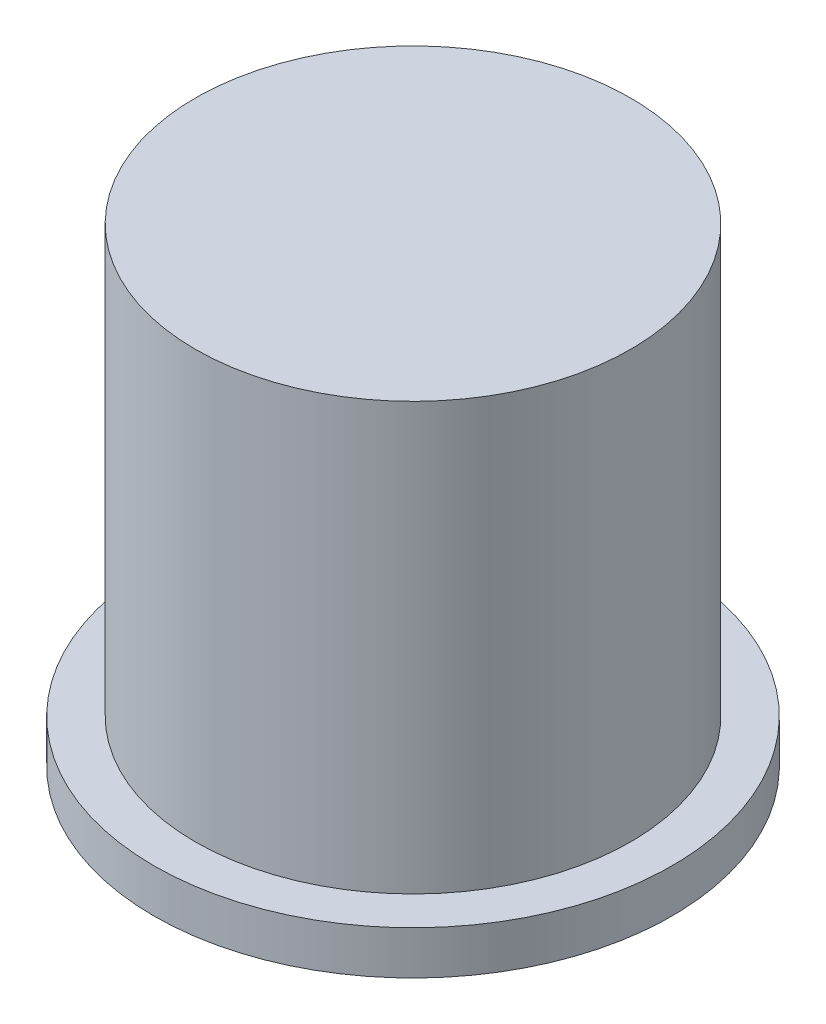
ISO-10303-21;
HEADER;
FILE_DESCRIPTION(('STEP AP214'),'2;1');
FILE_NAME('part.step','',(''),(''),'','','');
FILE_SCHEMA(('AUTOMOTIVE_DESIGN { 1 0 10303 214 1 1 1 1 }'));
ENDSEC;
DATA;
#1=APPLICATION_CONTEXT('core data for automotive mechanical design processes');
#2=APPLICATION_PROTOCOL_DEFINITION('international standard','automotive_design',2000,#1);
#3=PRODUCT_CONTEXT('',#1,'mechanical');
#4=PRODUCT('Part','Part','',(#3));
#5=PRODUCT_RELATED_PRODUCT_CATEGORY('part','',(#4));
#6=PRODUCT_DEFINITION_FORMATION('','',#4);
#7=PRODUCT_DEFINITION_CONTEXT('part definition',#1,'design');
#8=PRODUCT_DEFINITION('design','',#6,#7);
#9=PRODUCT_DEFINITION_SHAPE('','',#8);
#10=(LENGTH_UNIT() NAMED_UNIT(*) SI_UNIT(.MILLI.,.METRE.));
#11=(NAMED_UNIT(*) PLANE_ANGLE_UNIT() SI_UNIT($,.RADIAN.));
#12=(NAMED_UNIT(*) SI_UNIT($,.STERADIAN.) SOLID_ANGLE_UNIT());
#13=UNCERTAINTY_MEASURE_WITH_UNIT(LENGTH_MEASURE(1.E-05),#10,'distance_accuracy_value','');
#14=(GEOMETRIC_REPRESENTATION_CONTEXT(3) GLOBAL_UNCERTAINTY_ASSIGNED_CONTEXT((#13)) GLOBAL_UNIT_ASSIGNED_CONTEXT((#10,
#11,#12)) REPRESENTATION_CONTEXT('',''));
#15=CARTESIAN_POINT('',(0.,0.,0.));
#16=DIRECTION('',(0.,0.,1.));
#17=DIRECTION('',(1.,0.,0.));
#18=AXIS2_PLACEMENT_3D('',#15,#16,#17);
#19=CARTESIAN_POINT('',(0.,13.716,0.));
#20=DIRECTION('',(0.,-1.,0.));
#21=DIRECTION('',(0.,0.,-1.));
#22=AXIS2_PLACEMENT_3D('',#19,#20,#21);
#23=CYLINDRICAL_SURFACE('',#22,4.699);
#24=CARTESIAN_POINT('',(0.,0.,0.));
#25=DIRECTION('',(0.,1.,0.));
#26=DIRECTION('',(0.,0.,1.));
#27=AXIS2_PLACEMENT_3D('',#24,#25,#26);
#28=CIRCLE('',#27,4.699);
#29=CARTESIAN_POINT('',(0.,0.,4.699));
#30=VERTEX_POINT('',#29);
#31=EDGE_CURVE('E45',#30,#30,#28,.T.);
#32=ORIENTED_EDGE('',*,*,#31,.F.);
#33=EDGE_LOOP('',(#32));
#34=FACE_BOUND('',#33,.T.);
#35=CARTESIAN_POINT('',(0.,12.7,0.));
#36=DIRECTION('',(0.,1.,0.));
#37=DIRECTION('',(0.,0.,1.));
#38=AXIS2_PLACEMENT_3D('',#35,#36,#37);
#39=CIRCLE('',#38,4.699);
#40=CARTESIAN_POINT('',(0.,12.7,4.699));
#41=VERTEX_POINT('',#40);
#42=EDGE_CURVE('E41',#41,#41,#39,.T.);
#43=ORIENTED_EDGE('',*,*,#42,.T.);
#44=EDGE_LOOP('',(#43));
#45=FACE_BOUND('',#44,.T.);
#46=ADVANCED_FACE('F37',(#34,#45),#23,.F.);
#47=CARTESIAN_POINT('',(0.,13.716,0.));
#48=DIRECTION('',(0.,1.,0.));
#49=DIRECTION('',(0.,0.,1.));
#50=AXIS2_PLACEMENT_3D('',#47,#48,#49);
#51=PLANE('',#50);
#52=CARTESIAN_POINT('',(0.,13.716,0.));
#53=DIRECTION('',(0.,1.,0.));
#54=DIRECTION('',(0.,0.,1.));
#55=AXIS2_PLACEMENT_3D('',#52,#53,#54);
#56=CIRCLE('',#55,6.35);
#57=CARTESIAN_POINT('',(0.,13.716,6.35));
#58=VERTEX_POINT('',#57);
#59=EDGE_CURVE('E10',#58,#58,#56,.T.);
#60=ORIENTED_EDGE('',*,*,#59,.T.);
#61=EDGE_LOOP('',(#60));
#62=FACE_BOUND('',#61,.T.);
#63=ADVANCED_FACE('F82',(#62),#51,.T.);
#64=CARTESIAN_POINT('',(0.,0.,0.));
#65=DIRECTION('',(0.,1.,0.));
#66=DIRECTION('',(0.,0.,1.));
#67=AXIS2_PLACEMENT_3D('',#64,#65,#66);
#68=PLANE('',#67);
#69=CARTESIAN_POINT('',(0.,0.,0.));
#70=DIRECTION('',(0.,1.,0.));
#71=DIRECTION('',(0.,0.,1.));
#72=AXIS2_PLACEMENT_3D('',#69,#70,#71);
#73=CIRCLE('',#72,7.5565);
#74=CARTESIAN_POINT('',(0.,0.,7.5565));
#75=VERTEX_POINT('',#74);
#76=EDGE_CURVE('E58',#75,#75,#73,.T.);
#77=ORIENTED_EDGE('',*,*,#76,.F.);
#78=EDGE_LOOP('',(#77));
#79=FACE_BOUND('',#78,.T.);
#80=ORIENTED_EDGE('',*,*,#31,.T.);
#81=EDGE_LOOP('',(#80));
#82=FACE_BOUND('',#81,.T.);
#83=ADVANCED_FACE('F88',(#79,#82),#68,.F.);
#84=CARTESIAN_POINT('',(0.,13.716,0.));
#85=DIRECTION('',(0.,-1.,0.));
#86=DIRECTION('',(0.,0.,-1.));
#87=AXIS2_PLACEMENT_3D('',#84,#85,#86);
#88=CYLINDRICAL_SURFACE('',#87,6.35);
#89=ORIENTED_EDGE('',*,*,#59,.F.);
#90=EDGE_LOOP('',(#89));
#91=FACE_BOUND('',#90,.T.);
#92=CARTESIAN_POINT('',(0.,1.27,0.));
#93=DIRECTION('',(0.,1.,0.));
#94=DIRECTION('',(0.,0.,1.));
#95=AXIS2_PLACEMENT_3D('',#92,#93,#94);
#96=CIRCLE('',#95,6.35);
#97=CARTESIAN_POINT('',(0.,1.27,6.35));
#98=VERTEX_POINT('',#97);
#99=EDGE_CURVE('E50',#98,#98,#96,.T.);
#100=ORIENTED_EDGE('',*,*,#99,.T.);
#101=EDGE_LOOP('',(#100));
#102=FACE_BOUND('',#101,.T.);
#103=ADVANCED_FACE('F39',(#91,#102),#88,.T.);
#104=CARTESIAN_POINT('',(0.,1.27,0.));
#105=DIRECTION('',(0.,1.,0.));
#106=DIRECTION('',(0.,0.,1.));
#107=AXIS2_PLACEMENT_3D('',#104,#105,#106);
#108=PLANE('',#107);
#109=ORIENTED_EDGE('',*,*,#99,.F.);
#110=EDGE_LOOP('',(#109));
#111=FACE_BOUND('',#110,.T.);
#112=CARTESIAN_POINT('',(0.,1.27,0.));
#113=DIRECTION('',(0.,1.,0.));
#114=DIRECTION('',(0.,0.,1.));
#115=AXIS2_PLACEMENT_3D('',#112,#113,#114);
#116=CIRCLE('',#115,7.5565);
#117=CARTESIAN_POINT('',(0.,1.27,7.5565));
#118=VERTEX_POINT('',#117);
#119=EDGE_CURVE('E54',#118,#118,#116,.T.);
#120=ORIENTED_EDGE('',*,*,#119,.T.);
#121=EDGE_LOOP('',(#120));
#122=FACE_BOUND('',#121,.T.);
#123=ADVANCED_FACE('F77',(#111,#122),#108,.T.);
#124=CARTESIAN_POINT('',(0.,1.27,0.));
#125=DIRECTION('',(0.,-1.,0.));
#126=DIRECTION('',(0.,0.,-1.));
#127=AXIS2_PLACEMENT_3D('',#124,#125,#126);
#128=CYLINDRICAL_SURFACE('',#127,7.5565);
#129=ORIENTED_EDGE('',*,*,#119,.F.);
#130=EDGE_LOOP('',(#129));
#131=FACE_BOUND('',#130,.T.);
#132=ORIENTED_EDGE('',*,*,#76,.T.);
#133=EDGE_LOOP('',(#132));
#134=FACE_BOUND('',#133,.T.);
#135=ADVANCED_FACE('F71',(#131,#134),#128,.T.);
#136=CARTESIAN_POINT('',(0.,12.7,0.));
#137=DIRECTION('',(0.,1.,0.));
#138=DIRECTION('',(0.,0.,1.));
#139=AXIS2_PLACEMENT_3D('',#136,#137,#138);
#140=PLANE('',#139);
#141=ORIENTED_EDGE('',*,*,#42,.F.);
#142=EDGE_LOOP('',(#141));
#143=FACE_BOUND('',#142,.T.);
#144=ADVANCED_FACE('F69',(#143),#140,.F.);
#145=CLOSED_SHELL('',(#46,#63,#83,#103,#123,#135,#144));
#146=MANIFOLD_SOLID_BREP('B2',#145);
#147=ADVANCED_BREP_SHAPE_REPRESENTATION('',(#18,#146),#14);
#148=SHAPE_DEFINITION_REPRESENTATION(#9,#147);
ENDSEC;
END-ISO-10303-21;
